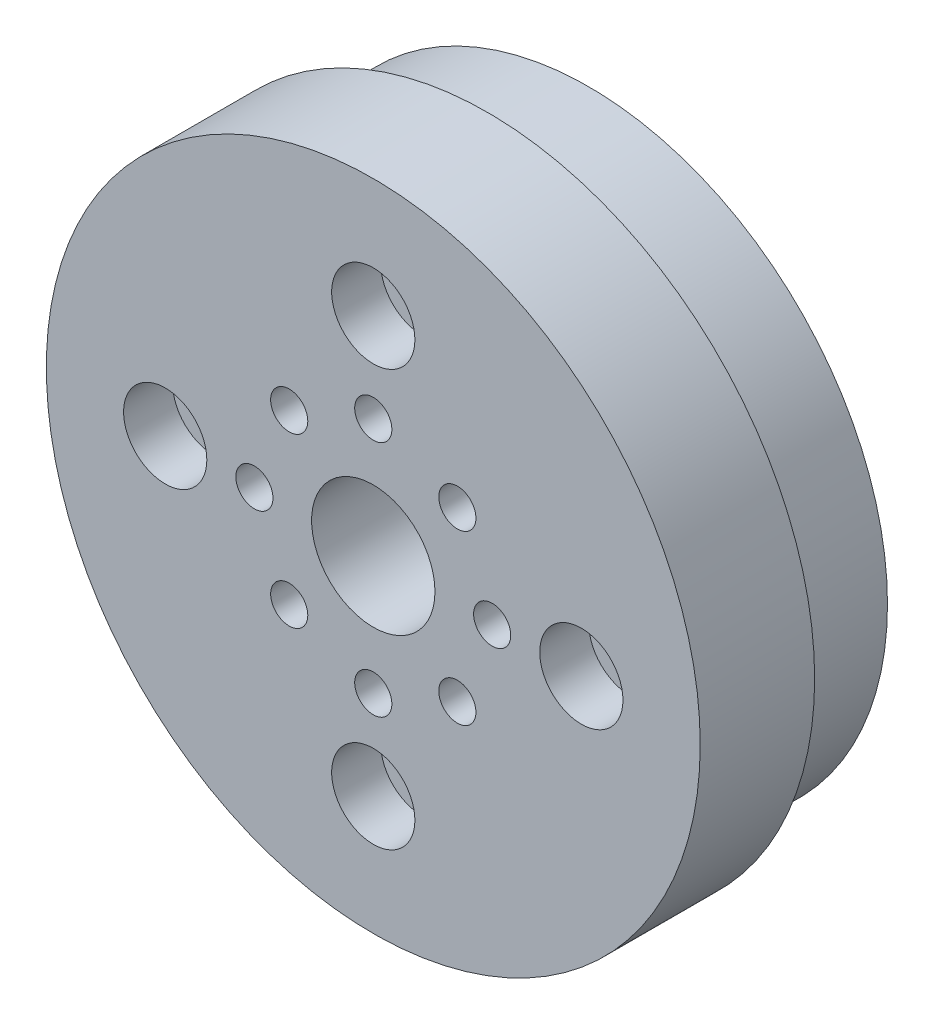
ISO-10303-21;
HEADER;
FILE_DESCRIPTION(('STEP AP214'),'2;1');
FILE_NAME('part.step','',(''),(''),'','','');
FILE_SCHEMA(('AUTOMOTIVE_DESIGN { 1 0 10303 214 1 1 1 1 }'));
ENDSEC;
DATA;
#1=APPLICATION_CONTEXT('core data for automotive mechanical design processes');
#2=APPLICATION_PROTOCOL_DEFINITION('international standard','automotive_design',2000,#1);
#3=PRODUCT_CONTEXT('',#1,'mechanical');
#4=PRODUCT('Part','Part','',(#3));
#5=PRODUCT_RELATED_PRODUCT_CATEGORY('part','',(#4));
#6=PRODUCT_DEFINITION_FORMATION('','',#4);
#7=PRODUCT_DEFINITION_CONTEXT('part definition',#1,'design');
#8=PRODUCT_DEFINITION('design','',#6,#7);
#9=PRODUCT_DEFINITION_SHAPE('','',#8);
#10=(LENGTH_UNIT() NAMED_UNIT(*) SI_UNIT(.MILLI.,.METRE.));
#11=(NAMED_UNIT(*) PLANE_ANGLE_UNIT() SI_UNIT($,.RADIAN.));
#12=(NAMED_UNIT(*) SI_UNIT($,.STERADIAN.) SOLID_ANGLE_UNIT());
#13=UNCERTAINTY_MEASURE_WITH_UNIT(LENGTH_MEASURE(1.E-05),#10,'distance_accuracy_value','');
#14=(GEOMETRIC_REPRESENTATION_CONTEXT(3) GLOBAL_UNCERTAINTY_ASSIGNED_CONTEXT((#13)) GLOBAL_UNIT_ASSIGNED_CONTEXT((#10,
#11,#12)) REPRESENTATION_CONTEXT('',''));
#15=CARTESIAN_POINT('',(0.,0.,0.));
#16=DIRECTION('',(0.,0.,1.));
#17=DIRECTION('',(1.,0.,0.));
#18=AXIS2_PLACEMENT_3D('',#15,#16,#17);
#19=CARTESIAN_POINT('',(0.,0.,7.7));
#20=DIRECTION('',(0.,0.,-1.));
#21=DIRECTION('',(-1.,0.,0.));
#22=AXIS2_PLACEMENT_3D('',#19,#20,#21);
#23=CYLINDRICAL_SURFACE('',#22,22.);
#24=CARTESIAN_POINT('',(0.,0.,7.7));
#25=DIRECTION('',(0.,0.,1.));
#26=DIRECTION('',(1.,0.,0.));
#27=AXIS2_PLACEMENT_3D('',#24,#25,#26);
#28=CIRCLE('',#27,22.);
#29=CARTESIAN_POINT('',(22.,0.,7.7));
#30=VERTEX_POINT('',#29);
#31=EDGE_CURVE('E51',#30,#30,#28,.T.);
#32=ORIENTED_EDGE('',*,*,#31,.F.);
#33=EDGE_LOOP('',(#32));
#34=FACE_BOUND('',#33,.T.);
#35=CARTESIAN_POINT('',(0.,0.,0.));
#36=DIRECTION('',(0.,0.,1.));
#37=DIRECTION('',(1.,0.,0.));
#38=AXIS2_PLACEMENT_3D('',#35,#36,#37);
#39=CIRCLE('',#38,22.);
#40=CARTESIAN_POINT('',(22.,0.,0.));
#41=VERTEX_POINT('',#40);
#42=EDGE_CURVE('E57',#41,#41,#39,.T.);
#43=ORIENTED_EDGE('',*,*,#42,.T.);
#44=EDGE_LOOP('',(#43));
#45=FACE_BOUND('',#44,.T.);
#46=ADVANCED_FACE('F43',(#34,#45),#23,.T.);
#47=CARTESIAN_POINT('',(0.,0.,7.7));
#48=DIRECTION('',(0.,0.,1.));
#49=DIRECTION('',(1.,0.,0.));
#50=AXIS2_PLACEMENT_3D('',#47,#48,#49);
#51=PLANE('',#50);
#52=CARTESIAN_POINT('',(14.,0.,7.7));
#53=DIRECTION('',(0.,0.,1.));
#54=DIRECTION('',(1.,0.,0.));
#55=AXIS2_PLACEMENT_3D('',#52,#53,#54);
#56=CIRCLE('',#55,2.8);
#57=CARTESIAN_POINT('',(16.8,0.,7.7));
#58=VERTEX_POINT('',#57);
#59=EDGE_CURVE('E134',#58,#58,#56,.T.);
#60=ORIENTED_EDGE('',*,*,#59,.F.);
#61=EDGE_LOOP('',(#60));
#62=FACE_BOUND('',#61,.T.);
#63=CARTESIAN_POINT('',(0.,-14.,7.7));
#64=DIRECTION('',(0.,0.,1.));
#65=DIRECTION('',(1.,0.,0.));
#66=AXIS2_PLACEMENT_3D('',#63,#64,#65);
#67=CIRCLE('',#66,2.8);
#68=CARTESIAN_POINT('',(2.79999999999995,-14.,7.7));
#69=VERTEX_POINT('',#68);
#70=EDGE_CURVE('E138',#69,#69,#67,.T.);
#71=ORIENTED_EDGE('',*,*,#70,.F.);
#72=EDGE_LOOP('',(#71));
#73=FACE_BOUND('',#72,.T.);
#74=CARTESIAN_POINT('',(-14.,0.,7.7));
#75=DIRECTION('',(0.,0.,1.));
#76=DIRECTION('',(1.,0.,0.));
#77=AXIS2_PLACEMENT_3D('',#74,#75,#76);
#78=CIRCLE('',#77,2.8);
#79=CARTESIAN_POINT('',(-11.2,0.,7.7));
#80=VERTEX_POINT('',#79);
#81=EDGE_CURVE('E146',#80,#80,#78,.T.);
#82=ORIENTED_EDGE('',*,*,#81,.F.);
#83=EDGE_LOOP('',(#82));
#84=FACE_BOUND('',#83,.T.);
#85=CARTESIAN_POINT('',(1.46642216231412E-13,14.,7.7));
#86=DIRECTION('',(0.,0.,1.));
#87=DIRECTION('',(1.,0.,0.));
#88=AXIS2_PLACEMENT_3D('',#85,#86,#87);
#89=CIRCLE('',#88,2.79999999999999);
#90=CARTESIAN_POINT('',(2.80000000000014,14.,7.7));
#91=VERTEX_POINT('',#90);
#92=EDGE_CURVE('E154',#91,#91,#89,.T.);
#93=ORIENTED_EDGE('',*,*,#92,.F.);
#94=EDGE_LOOP('',(#93));
#95=FACE_BOUND('',#94,.T.);
#96=CARTESIAN_POINT('',(0.,8.,7.7));
#97=DIRECTION('',(0.,0.,1.));
#98=DIRECTION('',(1.,0.,0.));
#99=AXIS2_PLACEMENT_3D('',#96,#97,#98);
#100=CIRCLE('',#99,1.25);
#101=CARTESIAN_POINT('',(1.25,8.,7.7));
#102=VERTEX_POINT('',#101);
#103=EDGE_CURVE('E177',#102,#102,#100,.T.);
#104=ORIENTED_EDGE('',*,*,#103,.F.);
#105=EDGE_LOOP('',(#104));
#106=FACE_BOUND('',#105,.T.);
#107=CARTESIAN_POINT('',(5.65685424949239,5.65685424949237,7.7));
#108=DIRECTION('',(0.,0.,1.));
#109=DIRECTION('',(1.,0.,0.));
#110=AXIS2_PLACEMENT_3D('',#107,#108,#109);
#111=CIRCLE('',#110,1.25);
#112=CARTESIAN_POINT('',(6.90685424949239,5.65685424949237,7.7));
#113=VERTEX_POINT('',#112);
#114=EDGE_CURVE('E181',#113,#113,#111,.T.);
#115=ORIENTED_EDGE('',*,*,#114,.F.);
#116=EDGE_LOOP('',(#115));
#117=FACE_BOUND('',#116,.T.);
#118=CARTESIAN_POINT('',(8.,0.,7.7));
#119=DIRECTION('',(0.,0.,1.));
#120=DIRECTION('',(1.,0.,0.));
#121=AXIS2_PLACEMENT_3D('',#118,#119,#120);
#122=CIRCLE('',#121,1.25);
#123=CARTESIAN_POINT('',(9.25,0.,7.7));
#124=VERTEX_POINT('',#123);
#125=EDGE_CURVE('E185',#124,#124,#122,.T.);
#126=ORIENTED_EDGE('',*,*,#125,.F.);
#127=EDGE_LOOP('',(#126));
#128=FACE_BOUND('',#127,.T.);
#129=CARTESIAN_POINT('',(5.65685424949235,-5.65685424949241,7.7));
#130=DIRECTION('',(0.,0.,1.));
#131=DIRECTION('',(1.,0.,0.));
#132=AXIS2_PLACEMENT_3D('',#129,#130,#131);
#133=CIRCLE('',#132,1.25);
#134=CARTESIAN_POINT('',(6.90685424949235,-5.65685424949241,7.7));
#135=VERTEX_POINT('',#134);
#136=EDGE_CURVE('E165',#135,#135,#133,.T.);
#137=ORIENTED_EDGE('',*,*,#136,.F.);
#138=EDGE_LOOP('',(#137));
#139=FACE_BOUND('',#138,.T.);
#140=CARTESIAN_POINT('',(0.,-8.,7.7));
#141=DIRECTION('',(0.,0.,1.));
#142=DIRECTION('',(1.,0.,0.));
#143=AXIS2_PLACEMENT_3D('',#140,#141,#142);
#144=CIRCLE('',#143,1.25);
#145=CARTESIAN_POINT('',(1.24999999999994,-8.,7.7));
#146=VERTEX_POINT('',#145);
#147=EDGE_CURVE('E161',#146,#146,#144,.T.);
#148=ORIENTED_EDGE('',*,*,#147,.F.);
#149=EDGE_LOOP('',(#148));
#150=FACE_BOUND('',#149,.T.);
#151=CARTESIAN_POINT('',(-5.65685424949243,-5.65685424949233,7.7));
#152=DIRECTION('',(0.,0.,1.));
#153=DIRECTION('',(1.,0.,0.));
#154=AXIS2_PLACEMENT_3D('',#151,#152,#153);
#155=CIRCLE('',#154,1.25);
#156=CARTESIAN_POINT('',(-4.40685424949243,-5.65685424949233,7.7));
#157=VERTEX_POINT('',#156);
#158=EDGE_CURVE('E166',#157,#157,#155,.T.);
#159=ORIENTED_EDGE('',*,*,#158,.F.);
#160=EDGE_LOOP('',(#159));
#161=FACE_BOUND('',#160,.T.);
#162=CARTESIAN_POINT('',(-8.,0.,7.7));
#163=DIRECTION('',(0.,0.,1.));
#164=DIRECTION('',(1.,0.,0.));
#165=AXIS2_PLACEMENT_3D('',#162,#163,#164);
#166=CIRCLE('',#165,1.25);
#167=CARTESIAN_POINT('',(-6.75,0.,7.7));
#168=VERTEX_POINT('',#167);
#169=EDGE_CURVE('E170',#168,#168,#166,.T.);
#170=ORIENTED_EDGE('',*,*,#169,.F.);
#171=EDGE_LOOP('',(#170));
#172=FACE_BOUND('',#171,.T.);
#173=CARTESIAN_POINT('',(-5.65685424949231,5.65685424949245,7.7));
#174=DIRECTION('',(0.,0.,1.));
#175=DIRECTION('',(1.,0.,0.));
#176=AXIS2_PLACEMENT_3D('',#173,#174,#175);
#177=CIRCLE('',#176,1.25);
#178=CARTESIAN_POINT('',(-4.40685424949231,5.65685424949245,7.7));
#179=VERTEX_POINT('',#178);
#180=EDGE_CURVE('E133',#179,#179,#177,.T.);
#181=ORIENTED_EDGE('',*,*,#180,.F.);
#182=EDGE_LOOP('',(#181));
#183=FACE_BOUND('',#182,.T.);
#184=CARTESIAN_POINT('',(0.,0.,7.7));
#185=DIRECTION('',(0.,0.,1.));
#186=DIRECTION('',(1.,0.,0.));
#187=AXIS2_PLACEMENT_3D('',#184,#185,#186);
#188=CIRCLE('',#187,4.15);
#189=CARTESIAN_POINT('',(4.15,0.,7.7));
#190=VERTEX_POINT('',#189);
#191=EDGE_CURVE('E66',#190,#190,#188,.T.);
#192=ORIENTED_EDGE('',*,*,#191,.F.);
#193=EDGE_LOOP('',(#192));
#194=FACE_BOUND('',#193,.T.);
#195=ORIENTED_EDGE('',*,*,#31,.T.);
#196=EDGE_LOOP('',(#195));
#197=FACE_BOUND('',#196,.T.);
#198=ADVANCED_FACE('F215',(#62,#73,#84,#95,#106,#117,#128,#139,#150,#161,#172,#183,#194,#197),
#51,.T.);
#199=CARTESIAN_POINT('',(0.,0.,0.));
#200=DIRECTION('',(0.,0.,1.));
#201=DIRECTION('',(1.,0.,0.));
#202=AXIS2_PLACEMENT_3D('',#199,#200,#201);
#203=PLANE('',#202);
#204=CARTESIAN_POINT('',(0.,0.,0.));
#205=DIRECTION('',(0.,0.,1.));
#206=DIRECTION('',(1.,0.,0.));
#207=AXIS2_PLACEMENT_3D('',#204,#205,#206);
#208=CIRCLE('',#207,20.1);
#209=CARTESIAN_POINT('',(20.1,0.,0.));
#210=VERTEX_POINT('',#209);
#211=EDGE_CURVE('E10',#210,#210,#208,.F.);
#212=ORIENTED_EDGE('',*,*,#211,.F.);
#213=EDGE_LOOP('',(#212));
#214=FACE_BOUND('',#213,.T.);
#215=ORIENTED_EDGE('',*,*,#42,.F.);
#216=EDGE_LOOP('',(#215));
#217=FACE_BOUND('',#216,.T.);
#218=ADVANCED_FACE('F212',(#214,#217),#203,.F.);
#219=CARTESIAN_POINT('',(0.,0.,-6.8));
#220=DIRECTION('',(0.,0.,-1.));
#221=DIRECTION('',(-1.,0.,0.));
#222=AXIS2_PLACEMENT_3D('',#219,#220,#221);
#223=PLANE('',#222);
#224=CARTESIAN_POINT('',(0.,0.,-6.8));
#225=DIRECTION('',(0.,0.,-1.));
#226=DIRECTION('',(-1.,0.,0.));
#227=AXIS2_PLACEMENT_3D('',#224,#225,#226);
#228=CIRCLE('',#227,20.1);
#229=CARTESIAN_POINT('',(-20.1,0.,-6.8));
#230=VERTEX_POINT('',#229);
#231=EDGE_CURVE('E199',#230,#230,#228,.T.);
#232=ORIENTED_EDGE('',*,*,#231,.T.);
#233=EDGE_LOOP('',(#232));
#234=FACE_BOUND('',#233,.T.);
#235=CARTESIAN_POINT('',(0.,0.,-6.8));
#236=DIRECTION('',(0.,0.,-1.));
#237=DIRECTION('',(-1.,0.,0.));
#238=AXIS2_PLACEMENT_3D('',#235,#236,#237);
#239=CIRCLE('',#238,18.1);
#240=CARTESIAN_POINT('',(-18.1,0.,-6.8));
#241=VERTEX_POINT('',#240);
#242=EDGE_CURVE('E195',#241,#241,#239,.T.);
#243=ORIENTED_EDGE('',*,*,#242,.F.);
#244=EDGE_LOOP('',(#243));
#245=FACE_BOUND('',#244,.T.);
#246=ADVANCED_FACE('F214',(#234,#245),#223,.T.);
#247=CARTESIAN_POINT('',(0.,0.,-6.8));
#248=DIRECTION('',(0.,0.,1.));
#249=DIRECTION('',(1.,0.,0.));
#250=AXIS2_PLACEMENT_3D('',#247,#248,#249);
#251=CYLINDRICAL_SURFACE('',#250,20.1);
#252=ORIENTED_EDGE('',*,*,#231,.F.);
#253=EDGE_LOOP('',(#252));
#254=FACE_BOUND('',#253,.T.);
#255=ORIENTED_EDGE('',*,*,#211,.T.);
#256=EDGE_LOOP('',(#255));
#257=FACE_BOUND('',#256,.T.);
#258=ADVANCED_FACE('F222',(#254,#257),#251,.T.);
#259=CARTESIAN_POINT('',(0.,0.,-6.8));
#260=DIRECTION('',(0.,0.,1.));
#261=DIRECTION('',(1.,0.,0.));
#262=AXIS2_PLACEMENT_3D('',#259,#260,#261);
#263=CYLINDRICAL_SURFACE('',#262,18.1);
#264=ORIENTED_EDGE('',*,*,#242,.T.);
#265=EDGE_LOOP('',(#264));
#266=FACE_BOUND('',#265,.T.);
#267=CARTESIAN_POINT('',(0.,0.,0.));
#268=DIRECTION('',(0.,0.,-1.));
#269=DIRECTION('',(-1.,0.,0.));
#270=AXIS2_PLACEMENT_3D('',#267,#268,#269);
#271=CIRCLE('',#270,18.1);
#272=CARTESIAN_POINT('',(-18.1,0.,0.));
#273=VERTEX_POINT('',#272);
#274=EDGE_CURVE('E98',#273,#273,#271,.T.);
#275=ORIENTED_EDGE('',*,*,#274,.F.);
#276=EDGE_LOOP('',(#275));
#277=FACE_BOUND('',#276,.T.);
#278=ADVANCED_FACE('F229',(#266,#277),#263,.F.);
#279=CARTESIAN_POINT('',(14.,0.,0.));
#280=DIRECTION('',(0.,0.,1.));
#281=DIRECTION('',(1.,0.,0.));
#282=AXIS2_PLACEMENT_3D('',#279,#280,#281);
#283=CIRCLE('',#282,1.6);
#284=CARTESIAN_POINT('',(15.6,0.,0.));
#285=VERTEX_POINT('',#284);
#286=EDGE_CURVE('E103',#285,#285,#283,.T.);
#287=ORIENTED_EDGE('',*,*,#286,.T.);
#288=EDGE_LOOP('',(#287));
#289=FACE_BOUND('',#288,.T.);
#290=CARTESIAN_POINT('',(0.,-14.,0.));
#291=DIRECTION('',(0.,0.,1.));
#292=DIRECTION('',(1.,0.,0.));
#293=AXIS2_PLACEMENT_3D('',#290,#291,#292);
#294=CIRCLE('',#293,1.6);
#295=CARTESIAN_POINT('',(1.59999999999995,-14.,0.));
#296=VERTEX_POINT('',#295);
#297=EDGE_CURVE('E107',#296,#296,#294,.T.);
#298=ORIENTED_EDGE('',*,*,#297,.T.);
#299=EDGE_LOOP('',(#298));
#300=FACE_BOUND('',#299,.T.);
#301=CARTESIAN_POINT('',(-14.,0.,0.));
#302=DIRECTION('',(0.,0.,1.));
#303=DIRECTION('',(1.,0.,0.));
#304=AXIS2_PLACEMENT_3D('',#301,#302,#303);
#305=CIRCLE('',#304,1.6);
#306=CARTESIAN_POINT('',(-12.4,0.,0.));
#307=VERTEX_POINT('',#306);
#308=EDGE_CURVE('E111',#307,#307,#305,.T.);
#309=ORIENTED_EDGE('',*,*,#308,.T.);
#310=EDGE_LOOP('',(#309));
#311=FACE_BOUND('',#310,.T.);
#312=CARTESIAN_POINT('',(1.46642216231412E-13,14.,0.));
#313=DIRECTION('',(0.,0.,1.));
#314=DIRECTION('',(1.,0.,0.));
#315=AXIS2_PLACEMENT_3D('',#312,#313,#314);
#316=CIRCLE('',#315,1.6);
#317=CARTESIAN_POINT('',(1.60000000000015,14.,0.));
#318=VERTEX_POINT('',#317);
#319=EDGE_CURVE('E124',#318,#318,#316,.T.);
#320=ORIENTED_EDGE('',*,*,#319,.T.);
#321=EDGE_LOOP('',(#320));
#322=FACE_BOUND('',#321,.T.);
#323=CARTESIAN_POINT('',(0.,8.,0.));
#324=DIRECTION('',(0.,0.,1.));
#325=DIRECTION('',(1.,0.,0.));
#326=AXIS2_PLACEMENT_3D('',#323,#324,#325);
#327=CIRCLE('',#326,1.25);
#328=CARTESIAN_POINT('',(1.25,8.,0.));
#329=VERTEX_POINT('',#328);
#330=EDGE_CURVE('E94',#329,#329,#327,.T.);
#331=ORIENTED_EDGE('',*,*,#330,.T.);
#332=EDGE_LOOP('',(#331));
#333=FACE_BOUND('',#332,.T.);
#334=CARTESIAN_POINT('',(5.65685424949239,5.65685424949237,0.));
#335=DIRECTION('',(0.,0.,1.));
#336=DIRECTION('',(1.,0.,0.));
#337=AXIS2_PLACEMENT_3D('',#334,#335,#336);
#338=CIRCLE('',#337,1.25);
#339=CARTESIAN_POINT('',(6.90685424949239,5.65685424949237,0.));
#340=VERTEX_POINT('',#339);
#341=EDGE_CURVE('E90',#340,#340,#338,.T.);
#342=ORIENTED_EDGE('',*,*,#341,.T.);
#343=EDGE_LOOP('',(#342));
#344=FACE_BOUND('',#343,.T.);
#345=CARTESIAN_POINT('',(8.,0.,0.));
#346=DIRECTION('',(0.,0.,1.));
#347=DIRECTION('',(1.,0.,0.));
#348=AXIS2_PLACEMENT_3D('',#345,#346,#347);
#349=CIRCLE('',#348,1.25);
#350=CARTESIAN_POINT('',(9.25,0.,0.));
#351=VERTEX_POINT('',#350);
#352=EDGE_CURVE('E86',#351,#351,#349,.T.);
#353=ORIENTED_EDGE('',*,*,#352,.T.);
#354=EDGE_LOOP('',(#353));
#355=FACE_BOUND('',#354,.T.);
#356=CARTESIAN_POINT('',(5.65685424949235,-5.65685424949241,0.));
#357=DIRECTION('',(0.,0.,1.));
#358=DIRECTION('',(1.,0.,0.));
#359=AXIS2_PLACEMENT_3D('',#356,#357,#358);
#360=CIRCLE('',#359,1.25);
#361=CARTESIAN_POINT('',(6.90685424949235,-5.65685424949241,0.));
#362=VERTEX_POINT('',#361);
#363=EDGE_CURVE('E82',#362,#362,#360,.T.);
#364=ORIENTED_EDGE('',*,*,#363,.T.);
#365=EDGE_LOOP('',(#364));
#366=FACE_BOUND('',#365,.T.);
#367=CARTESIAN_POINT('',(0.,-8.,0.));
#368=DIRECTION('',(0.,0.,1.));
#369=DIRECTION('',(1.,0.,0.));
#370=AXIS2_PLACEMENT_3D('',#367,#368,#369);
#371=CIRCLE('',#370,1.25);
#372=CARTESIAN_POINT('',(1.24999999999994,-8.,0.));
#373=VERTEX_POINT('',#372);
#374=EDGE_CURVE('E78',#373,#373,#371,.T.);
#375=ORIENTED_EDGE('',*,*,#374,.T.);
#376=EDGE_LOOP('',(#375));
#377=FACE_BOUND('',#376,.T.);
#378=CARTESIAN_POINT('',(-5.65685424949243,-5.65685424949233,0.));
#379=DIRECTION('',(0.,0.,1.));
#380=DIRECTION('',(1.,0.,0.));
#381=AXIS2_PLACEMENT_3D('',#378,#379,#380);
#382=CIRCLE('',#381,1.25);
#383=CARTESIAN_POINT('',(-4.40685424949243,-5.65685424949233,0.));
#384=VERTEX_POINT('',#383);
#385=EDGE_CURVE('E74',#384,#384,#382,.T.);
#386=ORIENTED_EDGE('',*,*,#385,.T.);
#387=EDGE_LOOP('',(#386));
#388=FACE_BOUND('',#387,.T.);
#389=CARTESIAN_POINT('',(-8.,0.,0.));
#390=DIRECTION('',(0.,0.,1.));
#391=DIRECTION('',(1.,0.,0.));
#392=AXIS2_PLACEMENT_3D('',#389,#390,#391);
#393=CIRCLE('',#392,1.25);
#394=CARTESIAN_POINT('',(-6.75,0.,0.));
#395=VERTEX_POINT('',#394);
#396=EDGE_CURVE('E70',#395,#395,#393,.T.);
#397=ORIENTED_EDGE('',*,*,#396,.T.);
#398=EDGE_LOOP('',(#397));
#399=FACE_BOUND('',#398,.T.);
#400=CARTESIAN_POINT('',(-5.65685424949231,5.65685424949245,0.));
#401=DIRECTION('',(0.,0.,1.));
#402=DIRECTION('',(1.,0.,0.));
#403=AXIS2_PLACEMENT_3D('',#400,#401,#402);
#404=CIRCLE('',#403,1.25);
#405=CARTESIAN_POINT('',(-4.40685424949231,5.65685424949245,0.));
#406=VERTEX_POINT('',#405);
#407=EDGE_CURVE('E65',#406,#406,#404,.T.);
#408=ORIENTED_EDGE('',*,*,#407,.T.);
#409=EDGE_LOOP('',(#408));
#410=FACE_BOUND('',#409,.T.);
#411=CARTESIAN_POINT('',(0.,0.,0.));
#412=DIRECTION('',(0.,0.,1.));
#413=DIRECTION('',(1.,0.,0.));
#414=AXIS2_PLACEMENT_3D('',#411,#412,#413);
#415=CIRCLE('',#414,4.15);
#416=CARTESIAN_POINT('',(4.15,0.,0.));
#417=VERTEX_POINT('',#416);
#418=EDGE_CURVE('E61',#417,#417,#415,.T.);
#419=ORIENTED_EDGE('',*,*,#418,.T.);
#420=EDGE_LOOP('',(#419));
#421=FACE_BOUND('',#420,.T.);
#422=ORIENTED_EDGE('',*,*,#274,.T.);
#423=EDGE_LOOP('',(#422));
#424=FACE_BOUND('',#423,.T.);
#425=ADVANCED_FACE('F217',(#289,#300,#311,#322,#333,#344,#355,#366,#377,#388,#399,#410,#421,
#424),#203,.F.);
#426=CARTESIAN_POINT('',(0.,0.,-6.8));
#427=DIRECTION('',(0.,0.,1.));
#428=DIRECTION('',(1.,0.,0.));
#429=AXIS2_PLACEMENT_3D('',#426,#427,#428);
#430=CYLINDRICAL_SURFACE('',#429,4.15);
#431=ORIENTED_EDGE('',*,*,#191,.T.);
#432=EDGE_LOOP('',(#431));
#433=FACE_BOUND('',#432,.T.);
#434=ORIENTED_EDGE('',*,*,#418,.F.);
#435=EDGE_LOOP('',(#434));
#436=FACE_BOUND('',#435,.T.);
#437=ADVANCED_FACE('F228',(#433,#436),#430,.F.);
#438=CARTESIAN_POINT('',(-5.65685424949231,5.65685424949245,-6.8));
#439=DIRECTION('',(0.,0.,1.));
#440=DIRECTION('',(1.,0.,0.));
#441=AXIS2_PLACEMENT_3D('',#438,#439,#440);
#442=CYLINDRICAL_SURFACE('',#441,1.25);
#443=ORIENTED_EDGE('',*,*,#180,.T.);
#444=EDGE_LOOP('',(#443));
#445=FACE_BOUND('',#444,.T.);
#446=ORIENTED_EDGE('',*,*,#407,.F.);
#447=EDGE_LOOP('',(#446));
#448=FACE_BOUND('',#447,.T.);
#449=ADVANCED_FACE('F287',(#445,#448),#442,.F.);
#450=CARTESIAN_POINT('',(-8.,0.,-6.8));
#451=DIRECTION('',(0.,0.,1.));
#452=DIRECTION('',(1.,0.,0.));
#453=AXIS2_PLACEMENT_3D('',#450,#451,#452);
#454=CYLINDRICAL_SURFACE('',#453,1.25);
#455=ORIENTED_EDGE('',*,*,#169,.T.);
#456=EDGE_LOOP('',(#455));
#457=FACE_BOUND('',#456,.T.);
#458=ORIENTED_EDGE('',*,*,#396,.F.);
#459=EDGE_LOOP('',(#458));
#460=FACE_BOUND('',#459,.T.);
#461=ADVANCED_FACE('F297',(#457,#460),#454,.F.);
#462=CARTESIAN_POINT('',(-5.65685424949243,-5.65685424949233,-6.8));
#463=DIRECTION('',(0.,0.,1.));
#464=DIRECTION('',(1.,0.,0.));
#465=AXIS2_PLACEMENT_3D('',#462,#463,#464);
#466=CYLINDRICAL_SURFACE('',#465,1.25);
#467=ORIENTED_EDGE('',*,*,#158,.T.);
#468=EDGE_LOOP('',(#467));
#469=FACE_BOUND('',#468,.T.);
#470=ORIENTED_EDGE('',*,*,#385,.F.);
#471=EDGE_LOOP('',(#470));
#472=FACE_BOUND('',#471,.T.);
#473=ADVANCED_FACE('F307',(#469,#472),#466,.F.);
#474=CARTESIAN_POINT('',(0.,-8.,-6.8));
#475=DIRECTION('',(0.,0.,1.));
#476=DIRECTION('',(1.,0.,0.));
#477=AXIS2_PLACEMENT_3D('',#474,#475,#476);
#478=CYLINDRICAL_SURFACE('',#477,1.25);
#479=ORIENTED_EDGE('',*,*,#147,.T.);
#480=EDGE_LOOP('',(#479));
#481=FACE_BOUND('',#480,.T.);
#482=ORIENTED_EDGE('',*,*,#374,.F.);
#483=EDGE_LOOP('',(#482));
#484=FACE_BOUND('',#483,.T.);
#485=ADVANCED_FACE('F317',(#481,#484),#478,.F.);
#486=CARTESIAN_POINT('',(5.65685424949235,-5.65685424949241,-6.8));
#487=DIRECTION('',(0.,0.,1.));
#488=DIRECTION('',(1.,0.,0.));
#489=AXIS2_PLACEMENT_3D('',#486,#487,#488);
#490=CYLINDRICAL_SURFACE('',#489,1.25);
#491=ORIENTED_EDGE('',*,*,#136,.T.);
#492=EDGE_LOOP('',(#491));
#493=FACE_BOUND('',#492,.T.);
#494=ORIENTED_EDGE('',*,*,#363,.F.);
#495=EDGE_LOOP('',(#494));
#496=FACE_BOUND('',#495,.T.);
#497=ADVANCED_FACE('F327',(#493,#496),#490,.F.);
#498=CARTESIAN_POINT('',(8.,0.,-6.8));
#499=DIRECTION('',(0.,0.,1.));
#500=DIRECTION('',(1.,0.,0.));
#501=AXIS2_PLACEMENT_3D('',#498,#499,#500);
#502=CYLINDRICAL_SURFACE('',#501,1.25);
#503=ORIENTED_EDGE('',*,*,#125,.T.);
#504=EDGE_LOOP('',(#503));
#505=FACE_BOUND('',#504,.T.);
#506=ORIENTED_EDGE('',*,*,#352,.F.);
#507=EDGE_LOOP('',(#506));
#508=FACE_BOUND('',#507,.T.);
#509=ADVANCED_FACE('F337',(#505,#508),#502,.F.);
#510=CARTESIAN_POINT('',(5.65685424949239,5.65685424949237,-6.8));
#511=DIRECTION('',(0.,0.,1.));
#512=DIRECTION('',(1.,0.,0.));
#513=AXIS2_PLACEMENT_3D('',#510,#511,#512);
#514=CYLINDRICAL_SURFACE('',#513,1.25);
#515=ORIENTED_EDGE('',*,*,#114,.T.);
#516=EDGE_LOOP('',(#515));
#517=FACE_BOUND('',#516,.T.);
#518=ORIENTED_EDGE('',*,*,#341,.F.);
#519=EDGE_LOOP('',(#518));
#520=FACE_BOUND('',#519,.T.);
#521=ADVANCED_FACE('F347',(#517,#520),#514,.F.);
#522=CARTESIAN_POINT('',(0.,8.,-6.8));
#523=DIRECTION('',(0.,0.,1.));
#524=DIRECTION('',(1.,0.,0.));
#525=AXIS2_PLACEMENT_3D('',#522,#523,#524);
#526=CYLINDRICAL_SURFACE('',#525,1.25);
#527=ORIENTED_EDGE('',*,*,#103,.T.);
#528=EDGE_LOOP('',(#527));
#529=FACE_BOUND('',#528,.T.);
#530=ORIENTED_EDGE('',*,*,#330,.F.);
#531=EDGE_LOOP('',(#530));
#532=FACE_BOUND('',#531,.T.);
#533=ADVANCED_FACE('F357',(#529,#532),#526,.F.);
#534=CARTESIAN_POINT('',(1.46642216231412E-13,14.,4.4));
#535=DIRECTION('',(0.,0.,1.));
#536=DIRECTION('',(1.,0.,0.));
#537=AXIS2_PLACEMENT_3D('',#534,#535,#536);
#538=CYLINDRICAL_SURFACE('',#537,2.79999999999999);
#539=CARTESIAN_POINT('',(1.46642216231412E-13,14.,4.4));
#540=DIRECTION('',(0.,0.,1.));
#541=DIRECTION('',(1.,0.,0.));
#542=AXIS2_PLACEMENT_3D('',#539,#540,#541);
#543=CIRCLE('',#542,2.79999999999999);
#544=CARTESIAN_POINT('',(2.80000000000014,14.,4.4));
#545=VERTEX_POINT('',#544);
#546=EDGE_CURVE('E128',#545,#545,#543,.T.);
#547=ORIENTED_EDGE('',*,*,#546,.F.);
#548=EDGE_LOOP('',(#547));
#549=FACE_BOUND('',#548,.T.);
#550=ORIENTED_EDGE('',*,*,#92,.T.);
#551=EDGE_LOOP('',(#550));
#552=FACE_BOUND('',#551,.T.);
#553=ADVANCED_FACE('F366',(#549,#552),#538,.F.);
#554=CARTESIAN_POINT('',(1.46642216231412E-13,14.,4.4));
#555=DIRECTION('',(0.,0.,1.));
#556=DIRECTION('',(1.,0.,0.));
#557=AXIS2_PLACEMENT_3D('',#554,#555,#556);
#558=PLANE('',#557);
#559=CARTESIAN_POINT('',(1.46642216231412E-13,14.,4.4));
#560=DIRECTION('',(0.,0.,1.));
#561=DIRECTION('',(1.,0.,0.));
#562=AXIS2_PLACEMENT_3D('',#559,#560,#561);
#563=CIRCLE('',#562,1.6);
#564=CARTESIAN_POINT('',(1.60000000000015,14.,4.4));
#565=VERTEX_POINT('',#564);
#566=EDGE_CURVE('E46',#565,#565,#563,.T.);
#567=ORIENTED_EDGE('',*,*,#566,.F.);
#568=EDGE_LOOP('',(#567));
#569=FACE_BOUND('',#568,.T.);
#570=ORIENTED_EDGE('',*,*,#546,.T.);
#571=EDGE_LOOP('',(#570));
#572=FACE_BOUND('',#571,.T.);
#573=ADVANCED_FACE('F375',(#569,#572),#558,.T.);
#574=CARTESIAN_POINT('',(-14.,0.,4.4));
#575=DIRECTION('',(0.,0.,1.));
#576=DIRECTION('',(1.,0.,0.));
#577=AXIS2_PLACEMENT_3D('',#574,#575,#576);
#578=CYLINDRICAL_SURFACE('',#577,2.8);
#579=CARTESIAN_POINT('',(-14.,0.,4.4));
#580=DIRECTION('',(0.,0.,1.));
#581=DIRECTION('',(1.,0.,0.));
#582=AXIS2_PLACEMENT_3D('',#579,#580,#581);
#583=CIRCLE('',#582,2.8);
#584=CARTESIAN_POINT('',(-11.2,0.,4.4));
#585=VERTEX_POINT('',#584);
#586=EDGE_CURVE('E150',#585,#585,#583,.T.);
#587=ORIENTED_EDGE('',*,*,#586,.F.);
#588=EDGE_LOOP('',(#587));
#589=FACE_BOUND('',#588,.T.);
#590=ORIENTED_EDGE('',*,*,#81,.T.);
#591=EDGE_LOOP('',(#590));
#592=FACE_BOUND('',#591,.T.);
#593=ADVANCED_FACE('F386',(#589,#592),#578,.F.);
#594=CARTESIAN_POINT('',(-14.,0.,4.4));
#595=DIRECTION('',(0.,0.,1.));
#596=DIRECTION('',(1.,0.,0.));
#597=AXIS2_PLACEMENT_3D('',#594,#595,#596);
#598=PLANE('',#597);
#599=CARTESIAN_POINT('',(-14.,0.,4.4));
#600=DIRECTION('',(0.,0.,1.));
#601=DIRECTION('',(1.,0.,0.));
#602=AXIS2_PLACEMENT_3D('',#599,#600,#601);
#603=CIRCLE('',#602,1.6);
#604=CARTESIAN_POINT('',(-12.4,0.,4.4));
#605=VERTEX_POINT('',#604);
#606=EDGE_CURVE('E108',#605,#605,#603,.T.);
#607=ORIENTED_EDGE('',*,*,#606,.F.);
#608=EDGE_LOOP('',(#607));
#609=FACE_BOUND('',#608,.T.);
#610=ORIENTED_EDGE('',*,*,#586,.T.);
#611=EDGE_LOOP('',(#610));
#612=FACE_BOUND('',#611,.T.);
#613=ADVANCED_FACE('F396',(#609,#612),#598,.T.);
#614=CARTESIAN_POINT('',(0.,-14.,4.4));
#615=DIRECTION('',(0.,0.,1.));
#616=DIRECTION('',(1.,0.,0.));
#617=AXIS2_PLACEMENT_3D('',#614,#615,#616);
#618=CYLINDRICAL_SURFACE('',#617,2.8);
#619=CARTESIAN_POINT('',(0.,-14.,4.4));
#620=DIRECTION('',(0.,0.,1.));
#621=DIRECTION('',(1.,0.,0.));
#622=AXIS2_PLACEMENT_3D('',#619,#620,#621);
#623=CIRCLE('',#622,2.8);
#624=CARTESIAN_POINT('',(2.79999999999995,-14.,4.4));
#625=VERTEX_POINT('',#624);
#626=EDGE_CURVE('E142',#625,#625,#623,.T.);
#627=ORIENTED_EDGE('',*,*,#626,.F.);
#628=EDGE_LOOP('',(#627));
#629=FACE_BOUND('',#628,.T.);
#630=ORIENTED_EDGE('',*,*,#70,.T.);
#631=EDGE_LOOP('',(#630));
#632=FACE_BOUND('',#631,.T.);
#633=ADVANCED_FACE('F406',(#629,#632),#618,.F.);
#634=CARTESIAN_POINT('',(0.,-14.,4.4));
#635=DIRECTION('',(0.,0.,1.));
#636=DIRECTION('',(1.,0.,0.));
#637=AXIS2_PLACEMENT_3D('',#634,#635,#636);
#638=PLANE('',#637);
#639=CARTESIAN_POINT('',(0.,-14.,4.4));
#640=DIRECTION('',(0.,0.,1.));
#641=DIRECTION('',(1.,0.,0.));
#642=AXIS2_PLACEMENT_3D('',#639,#640,#641);
#643=CIRCLE('',#642,1.6);
#644=CARTESIAN_POINT('',(1.59999999999995,-14.,4.4));
#645=VERTEX_POINT('',#644);
#646=EDGE_CURVE('E104',#645,#645,#643,.T.);
#647=ORIENTED_EDGE('',*,*,#646,.F.);
#648=EDGE_LOOP('',(#647));
#649=FACE_BOUND('',#648,.T.);
#650=ORIENTED_EDGE('',*,*,#626,.T.);
#651=EDGE_LOOP('',(#650));
#652=FACE_BOUND('',#651,.T.);
#653=ADVANCED_FACE('F416',(#649,#652),#638,.T.);
#654=CARTESIAN_POINT('',(14.,0.,4.4));
#655=DIRECTION('',(0.,0.,1.));
#656=DIRECTION('',(1.,0.,0.));
#657=AXIS2_PLACEMENT_3D('',#654,#655,#656);
#658=CYLINDRICAL_SURFACE('',#657,2.8);
#659=CARTESIAN_POINT('',(14.,0.,4.4));
#660=DIRECTION('',(0.,0.,1.));
#661=DIRECTION('',(1.,0.,0.));
#662=AXIS2_PLACEMENT_3D('',#659,#660,#661);
#663=CIRCLE('',#662,2.8);
#664=CARTESIAN_POINT('',(16.8,0.,4.4));
#665=VERTEX_POINT('',#664);
#666=EDGE_CURVE('E129',#665,#665,#663,.T.);
#667=ORIENTED_EDGE('',*,*,#666,.F.);
#668=EDGE_LOOP('',(#667));
#669=FACE_BOUND('',#668,.T.);
#670=ORIENTED_EDGE('',*,*,#59,.T.);
#671=EDGE_LOOP('',(#670));
#672=FACE_BOUND('',#671,.T.);
#673=ADVANCED_FACE('F426',(#669,#672),#658,.F.);
#674=CARTESIAN_POINT('',(14.,0.,4.4));
#675=DIRECTION('',(0.,0.,1.));
#676=DIRECTION('',(1.,0.,0.));
#677=AXIS2_PLACEMENT_3D('',#674,#675,#676);
#678=PLANE('',#677);
#679=CARTESIAN_POINT('',(14.,0.,4.4));
#680=DIRECTION('',(0.,0.,1.));
#681=DIRECTION('',(1.,0.,0.));
#682=AXIS2_PLACEMENT_3D('',#679,#680,#681);
#683=CIRCLE('',#682,1.6);
#684=CARTESIAN_POINT('',(15.6,0.,4.4));
#685=VERTEX_POINT('',#684);
#686=EDGE_CURVE('E99',#685,#685,#683,.T.);
#687=ORIENTED_EDGE('',*,*,#686,.F.);
#688=EDGE_LOOP('',(#687));
#689=FACE_BOUND('',#688,.T.);
#690=ORIENTED_EDGE('',*,*,#666,.T.);
#691=EDGE_LOOP('',(#690));
#692=FACE_BOUND('',#691,.T.);
#693=ADVANCED_FACE('F436',(#689,#692),#678,.T.);
#694=CARTESIAN_POINT('',(14.,0.,-6.8));
#695=DIRECTION('',(0.,0.,1.));
#696=DIRECTION('',(1.,0.,0.));
#697=AXIS2_PLACEMENT_3D('',#694,#695,#696);
#698=CYLINDRICAL_SURFACE('',#697,1.6);
#699=ORIENTED_EDGE('',*,*,#686,.T.);
#700=EDGE_LOOP('',(#699));
#701=FACE_BOUND('',#700,.T.);
#702=ORIENTED_EDGE('',*,*,#286,.F.);
#703=EDGE_LOOP('',(#702));
#704=FACE_BOUND('',#703,.T.);
#705=ADVANCED_FACE('F445',(#701,#704),#698,.F.);
#706=CARTESIAN_POINT('',(0.,-14.,-6.8));
#707=DIRECTION('',(0.,0.,1.));
#708=DIRECTION('',(1.,0.,0.));
#709=AXIS2_PLACEMENT_3D('',#706,#707,#708);
#710=CYLINDRICAL_SURFACE('',#709,1.6);
#711=ORIENTED_EDGE('',*,*,#646,.T.);
#712=EDGE_LOOP('',(#711));
#713=FACE_BOUND('',#712,.T.);
#714=ORIENTED_EDGE('',*,*,#297,.F.);
#715=EDGE_LOOP('',(#714));
#716=FACE_BOUND('',#715,.T.);
#717=ADVANCED_FACE('F455',(#713,#716),#710,.F.);
#718=CARTESIAN_POINT('',(-14.,0.,-6.8));
#719=DIRECTION('',(0.,0.,1.));
#720=DIRECTION('',(1.,0.,0.));
#721=AXIS2_PLACEMENT_3D('',#718,#719,#720);
#722=CYLINDRICAL_SURFACE('',#721,1.6);
#723=ORIENTED_EDGE('',*,*,#606,.T.);
#724=EDGE_LOOP('',(#723));
#725=FACE_BOUND('',#724,.T.);
#726=ORIENTED_EDGE('',*,*,#308,.F.);
#727=EDGE_LOOP('',(#726));
#728=FACE_BOUND('',#727,.T.);
#729=ADVANCED_FACE('F465',(#725,#728),#722,.F.);
#730=CARTESIAN_POINT('',(1.46642216231412E-13,14.,-6.8));
#731=DIRECTION('',(0.,0.,1.));
#732=DIRECTION('',(1.,0.,0.));
#733=AXIS2_PLACEMENT_3D('',#730,#731,#732);
#734=CYLINDRICAL_SURFACE('',#733,1.6);
#735=ORIENTED_EDGE('',*,*,#566,.T.);
#736=EDGE_LOOP('',(#735));
#737=FACE_BOUND('',#736,.T.);
#738=ORIENTED_EDGE('',*,*,#319,.F.);
#739=EDGE_LOOP('',(#738));
#740=FACE_BOUND('',#739,.T.);
#741=ADVANCED_FACE('F475',(#737,#740),#734,.F.);
#742=CLOSED_SHELL('',(#46,#198,#218,#246,#258,#278,#425,#437,#449,#461,#473,#485,#497,#509,#521,
#533,#553,#573,#593,#613,#633,#653,#673,#693,#705,#717,#729,#741));
#743=MANIFOLD_SOLID_BREP('B2',#742);
#744=ADVANCED_BREP_SHAPE_REPRESENTATION('',(#18,#743),#14);
#745=SHAPE_DEFINITION_REPRESENTATION(#9,#744);
ENDSEC;
END-ISO-10303-21;
